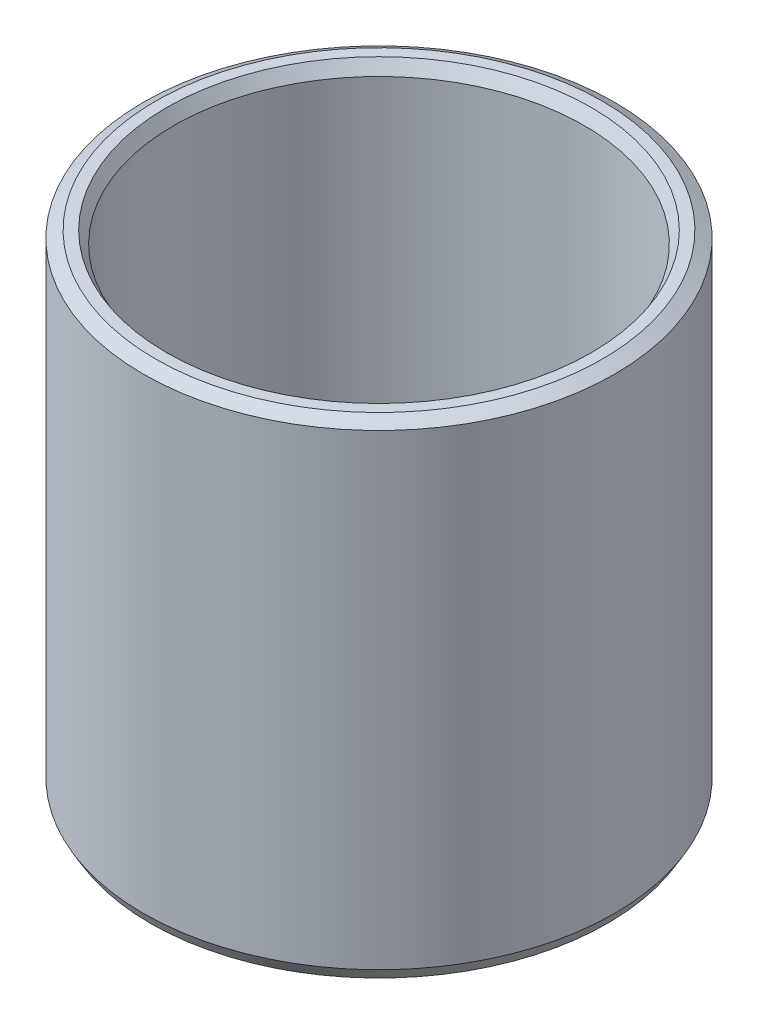
ISO-10303-21;
HEADER;
FILE_DESCRIPTION(('STEP AP214'),'2;1');
FILE_NAME('part.step','',(''),(''),'','','');
FILE_SCHEMA(('AUTOMOTIVE_DESIGN { 1 0 10303 214 1 1 1 1 }'));
ENDSEC;
DATA;
#1=APPLICATION_CONTEXT('core data for automotive mechanical design processes');
#2=APPLICATION_PROTOCOL_DEFINITION('international standard','automotive_design',2000,#1);
#3=PRODUCT_CONTEXT('',#1,'mechanical');
#4=PRODUCT('Part','Part','',(#3));
#5=PRODUCT_RELATED_PRODUCT_CATEGORY('part','',(#4));
#6=PRODUCT_DEFINITION_FORMATION('','',#4);
#7=PRODUCT_DEFINITION_CONTEXT('part definition',#1,'design');
#8=PRODUCT_DEFINITION('design','',#6,#7);
#9=PRODUCT_DEFINITION_SHAPE('','',#8);
#10=(LENGTH_UNIT() NAMED_UNIT(*) SI_UNIT(.MILLI.,.METRE.));
#11=(NAMED_UNIT(*) PLANE_ANGLE_UNIT() SI_UNIT($,.RADIAN.));
#12=(NAMED_UNIT(*) SI_UNIT($,.STERADIAN.) SOLID_ANGLE_UNIT());
#13=UNCERTAINTY_MEASURE_WITH_UNIT(LENGTH_MEASURE(1.E-05),#10,'distance_accuracy_value','');
#14=(GEOMETRIC_REPRESENTATION_CONTEXT(3) GLOBAL_UNCERTAINTY_ASSIGNED_CONTEXT((#13)) GLOBAL_UNIT_ASSIGNED_CONTEXT((#10,
#11,#12)) REPRESENTATION_CONTEXT('',''));
#15=CARTESIAN_POINT('',(0.,0.,0.));
#16=DIRECTION('',(0.,0.,1.));
#17=DIRECTION('',(1.,0.,0.));
#18=AXIS2_PLACEMENT_3D('',#15,#16,#17);
#19=CARTESIAN_POINT('',(0.,72.2339889807118,0.));
#20=DIRECTION('',(0.,-1.,0.));
#21=DIRECTION('',(0.,0.,-1.));
#22=AXIS2_PLACEMENT_3D('',#19,#20,#21);
#23=CYLINDRICAL_SURFACE('',#22,35.);
#24=CARTESIAN_POINT('',(0.,1.80621236917806,0.));
#25=DIRECTION('',(0.,1.,0.));
#26=DIRECTION('',(0.,0.,1.));
#27=AXIS2_PLACEMENT_3D('',#24,#25,#26);
#28=CIRCLE('',#27,35.);
#29=CARTESIAN_POINT('',(0.,1.80621236917806,35.));
#30=VERTEX_POINT('',#29);
#31=EDGE_CURVE('E10',#30,#30,#28,.T.);
#32=ORIENTED_EDGE('',*,*,#31,.T.);
#33=EDGE_LOOP('',(#32));
#34=FACE_BOUND('',#33,.T.);
#35=CARTESIAN_POINT('',(0.,71.1911717831532,0.));
#36=DIRECTION('',(0.,1.,0.));
#37=DIRECTION('',(0.,0.,1.));
#38=AXIS2_PLACEMENT_3D('',#35,#36,#37);
#39=CIRCLE('',#38,35.);
#40=CARTESIAN_POINT('',(0.,71.1911717831532,35.));
#41=VERTEX_POINT('',#40);
#42=EDGE_CURVE('E50',#41,#41,#39,.F.);
#43=ORIENTED_EDGE('',*,*,#42,.T.);
#44=EDGE_LOOP('',(#43));
#45=FACE_BOUND('',#44,.T.);
#46=ADVANCED_FACE('F39',(#34,#45),#23,.T.);
#47=CARTESIAN_POINT('',(0.,72.2339889807118,0.));
#48=DIRECTION('',(0.,1.,0.));
#49=DIRECTION('',(0.,0.,1.));
#50=AXIS2_PLACEMENT_3D('',#47,#48,#49);
#51=PLANE('',#50);
#52=CARTESIAN_POINT('',(0.,72.2339889807118,0.));
#53=DIRECTION('',(0.,1.,0.));
#54=DIRECTION('',(0.,0.,1.));
#55=AXIS2_PLACEMENT_3D('',#52,#53,#54);
#56=CIRCLE('',#55,31.5551612675775);
#57=CARTESIAN_POINT('',(0.,72.2339889807118,31.5551612675775));
#58=VERTEX_POINT('',#57);
#59=EDGE_CURVE('E58',#58,#58,#56,.F.);
#60=ORIENTED_EDGE('',*,*,#59,.T.);
#61=EDGE_LOOP('',(#60));
#62=FACE_BOUND('',#61,.T.);
#63=CARTESIAN_POINT('',(0.,72.2339889807118,0.));
#64=DIRECTION('',(0.,1.,0.));
#65=DIRECTION('',(0.,0.,1.));
#66=AXIS2_PLACEMENT_3D('',#63,#64,#65);
#67=CIRCLE('',#66,33.193787630822);
#68=CARTESIAN_POINT('',(0.,72.2339889807118,33.193787630822));
#69=VERTEX_POINT('',#68);
#70=EDGE_CURVE('E61',#69,#69,#67,.T.);
#71=ORIENTED_EDGE('',*,*,#70,.T.);
#72=EDGE_LOOP('',(#71));
#73=FACE_BOUND('',#72,.T.);
#74=ADVANCED_FACE('F88',(#62,#73),#51,.T.);
#75=CARTESIAN_POINT('',(0.,0.,0.));
#76=DIRECTION('',(0.,1.,0.));
#77=DIRECTION('',(0.,0.,1.));
#78=AXIS2_PLACEMENT_3D('',#75,#76,#77);
#79=PLANE('',#78);
#80=CARTESIAN_POINT('',(0.,0.,0.));
#81=DIRECTION('',(0.,1.,0.));
#82=DIRECTION('',(0.,0.,1.));
#83=AXIS2_PLACEMENT_3D('',#80,#81,#82);
#84=CIRCLE('',#83,32.318556439197);
#85=CARTESIAN_POINT('',(0.,0.,32.318556439197));
#86=VERTEX_POINT('',#85);
#87=EDGE_CURVE('E51',#86,#86,#84,.T.);
#88=ORIENTED_EDGE('',*,*,#87,.T.);
#89=EDGE_LOOP('',(#88));
#90=FACE_BOUND('',#89,.T.);
#91=CARTESIAN_POINT('',(0.,0.,0.));
#92=DIRECTION('',(0.,1.,0.));
#93=DIRECTION('',(0.,0.,1.));
#94=AXIS2_PLACEMENT_3D('',#91,#92,#93);
#95=CIRCLE('',#94,33.9571828024414);
#96=CARTESIAN_POINT('',(0.,0.,33.9571828024414));
#97=VERTEX_POINT('',#96);
#98=EDGE_CURVE('E54',#97,#97,#95,.F.);
#99=ORIENTED_EDGE('',*,*,#98,.T.);
#100=EDGE_LOOP('',(#99));
#101=FACE_BOUND('',#100,.T.);
#102=ADVANCED_FACE('F83',(#90,#101),#79,.F.);
#103=CARTESIAN_POINT('',(0.,72.2339889807118,0.));
#104=DIRECTION('',(0.,-1.,0.));
#105=DIRECTION('',(0.,0.,-1.));
#106=AXIS2_PLACEMENT_3D('',#103,#104,#105);
#107=CYLINDRICAL_SURFACE('',#106,30.5123440700189);
#108=CARTESIAN_POINT('',(0.,70.4277766115337,0.));
#109=DIRECTION('',(0.,1.,0.));
#110=DIRECTION('',(0.,0.,1.));
#111=AXIS2_PLACEMENT_3D('',#108,#109,#110);
#112=CIRCLE('',#111,30.5123440700189);
#113=CARTESIAN_POINT('',(0.,70.4277766115337,30.5123440700189));
#114=VERTEX_POINT('',#113);
#115=EDGE_CURVE('E67',#114,#114,#112,.T.);
#116=ORIENTED_EDGE('',*,*,#115,.T.);
#117=EDGE_LOOP('',(#116));
#118=FACE_BOUND('',#117,.T.);
#119=CARTESIAN_POINT('',(0.,1.04281719755861,0.));
#120=DIRECTION('',(0.,1.,0.));
#121=DIRECTION('',(0.,0.,1.));
#122=AXIS2_PLACEMENT_3D('',#119,#120,#121);
#123=CIRCLE('',#122,30.5123440700189);
#124=CARTESIAN_POINT('',(0.,1.04281719755861,30.5123440700189));
#125=VERTEX_POINT('',#124);
#126=EDGE_CURVE('E69',#125,#125,#123,.F.);
#127=ORIENTED_EDGE('',*,*,#126,.T.);
#128=EDGE_LOOP('',(#127));
#129=FACE_BOUND('',#128,.T.);
#130=ADVANCED_FACE('F71',(#118,#129),#107,.F.);
#131=CARTESIAN_POINT('',(0.,70.4277766115337,0.));
#132=DIRECTION('',(0.,1.,0.));
#133=DIRECTION('',(0.,0.,1.));
#134=AXIS2_PLACEMENT_3D('',#131,#132,#133);
#135=CONICAL_SURFACE('',#134,30.5123440700189,0.523598775598293);
#136=ORIENTED_EDGE('',*,*,#59,.F.);
#137=EDGE_LOOP('',(#136));
#138=FACE_BOUND('',#137,.T.);
#139=ORIENTED_EDGE('',*,*,#115,.F.);
#140=EDGE_LOOP('',(#139));
#141=FACE_BOUND('',#140,.T.);
#142=ADVANCED_FACE('F77',(#138,#141),#135,.F.);
#143=CARTESIAN_POINT('',(0.,0.,0.));
#144=DIRECTION('',(0.,-1.,0.));
#145=DIRECTION('',(0.,0.,-1.));
#146=AXIS2_PLACEMENT_3D('',#143,#144,#145);
#147=CONICAL_SURFACE('',#146,32.318556439197,1.04719755119659);
#148=ORIENTED_EDGE('',*,*,#126,.F.);
#149=EDGE_LOOP('',(#148));
#150=FACE_BOUND('',#149,.T.);
#151=ORIENTED_EDGE('',*,*,#87,.F.);
#152=EDGE_LOOP('',(#151));
#153=FACE_BOUND('',#152,.T.);
#154=ADVANCED_FACE('F73',(#150,#153),#147,.F.);
#155=CARTESIAN_POINT('',(0.,1.80621236917806,0.));
#156=DIRECTION('',(0.,1.,0.));
#157=DIRECTION('',(0.,0.,1.));
#158=AXIS2_PLACEMENT_3D('',#155,#156,#157);
#159=CONICAL_SURFACE('',#158,35.,0.5235987755983);
#160=CARTESIAN_POINT('',(0.,0.,33.9571828024414));
#161=CARTESIAN_POINT('',(0.,0.0188147121789396,33.9680454815826));
#162=CARTESIAN_POINT('',(0.,0.0376294243578772,33.9789081607239));
#163=CARTESIAN_POINT('',(0.,0.0752588487157524,34.0006335190064));
#164=CARTESIAN_POINT('',(0.,0.09407356089469,34.0114961981476));
#165=CARTESIAN_POINT('',(0.,0.131702985252567,34.0332215564301));
#166=CARTESIAN_POINT('',(0.,0.150517697431506,34.0440842355713));
#167=CARTESIAN_POINT('',(0.,0.188147121789382,34.0658095938538));
#168=CARTESIAN_POINT('',(0.,0.206961833968319,34.076672272995));
#169=CARTESIAN_POINT('',(0.,0.244591258326195,34.0983976312775));
#170=CARTESIAN_POINT('',(0.,0.263405970505134,34.1092603104187));
#171=CARTESIAN_POINT('',(0.,0.301035394863011,34.1309856687012));
#172=CARTESIAN_POINT('',(0.,0.319850107041949,34.1418483478424));
#173=CARTESIAN_POINT('',(0.,0.357479531399825,34.1635737061249));
#174=CARTESIAN_POINT('',(0.,0.376294243578763,34.1744363852661));
#175=CARTESIAN_POINT('',(0.,0.413923667936639,34.1961617435486));
#176=CARTESIAN_POINT('',(0.,0.432738380115578,34.2070244226898));
#177=CARTESIAN_POINT('',(0.,0.470367804473455,34.2287497809723));
#178=CARTESIAN_POINT('',(0.,0.489182516652392,34.2396124601135));
#179=CARTESIAN_POINT('',(0.,0.526811941010268,34.261337818396));
#180=CARTESIAN_POINT('',(0.,0.545626653189206,34.2722004975372));
#181=CARTESIAN_POINT('',(0.,0.583256077547084,34.2939258558197));
#182=CARTESIAN_POINT('',(0.,0.602070789726022,34.3047885349609));
#183=CARTESIAN_POINT('',(0.,0.639700214083898,34.3265138932434));
#184=CARTESIAN_POINT('',(0.,0.658514926262835,34.3373765723847));
#185=CARTESIAN_POINT('',(0.,0.696144350620712,34.3591019306671));
#186=CARTESIAN_POINT('',(0.,0.714959062799651,34.3699646098084));
#187=CARTESIAN_POINT('',(0.,0.752588487157527,34.3916899680908));
#188=CARTESIAN_POINT('',(0.,0.771403199336465,34.4025526472321));
#189=CARTESIAN_POINT('',(0.,0.809032623694341,34.4242780055145));
#190=CARTESIAN_POINT('',(0.,0.827847335873279,34.4351406846558));
#191=CARTESIAN_POINT('',(0.,0.865476760231156,34.4568660429382));
#192=CARTESIAN_POINT('',(0.,0.884291472410095,34.4677287220795));
#193=CARTESIAN_POINT('',(0.,0.921920896767971,34.489454080362));
#194=CARTESIAN_POINT('',(0.,0.940735608946908,34.5003167595032));
#195=CARTESIAN_POINT('',(0.,0.978365033304784,34.5220421177857));
#196=CARTESIAN_POINT('',(0.,0.997179745483724,34.5329047969269));
#197=CARTESIAN_POINT('',(0.,1.0348091698416,34.5546301552094));
#198=CARTESIAN_POINT('',(0.,1.05362388202054,34.5654928343506));
#199=CARTESIAN_POINT('',(0.,1.09125330637841,34.5872181926331));
#200=CARTESIAN_POINT('',(0.,1.11006801855735,34.5980808717743));
#201=CARTESIAN_POINT('',(0.,1.14769744291523,34.6198062300568));
#202=CARTESIAN_POINT('',(0.,1.16651215509417,34.630668909198));
#203=CARTESIAN_POINT('',(0.,1.20414157945204,34.6523942674805));
#204=CARTESIAN_POINT('',(0.,1.22295629163098,34.6632569466217));
#205=CARTESIAN_POINT('',(0.,1.26058571598886,34.6849823049042));
#206=CARTESIAN_POINT('',(0.,1.2794004281678,34.6958449840454));
#207=CARTESIAN_POINT('',(0.,1.31702985252567,34.7175703423279));
#208=CARTESIAN_POINT('',(0.,1.33584456470461,34.7284330214691));
#209=CARTESIAN_POINT('',(0.,1.37347398906249,34.7501583797516));
#210=CARTESIAN_POINT('',(0.,1.39228870124143,34.7610210588928));
#211=CARTESIAN_POINT('',(0.,1.4299181255993,34.7827464171753));
#212=CARTESIAN_POINT('',(0.,1.44873283777824,34.7936090963165));
#213=CARTESIAN_POINT('',(0.,1.48636226213611,34.815334454599));
#214=CARTESIAN_POINT('',(0.,1.50517697431505,34.8261971337402));
#215=CARTESIAN_POINT('',(0.,1.54280639867293,34.8479224920227));
#216=CARTESIAN_POINT('',(0.,1.56162111085187,34.8587851711639));
#217=CARTESIAN_POINT('',(0.,1.59925053520975,34.8805105294464));
#218=CARTESIAN_POINT('',(0.,1.61806524738868,34.8913732085877));
#219=CARTESIAN_POINT('',(0.,1.65569467174656,34.9130985668701));
#220=CARTESIAN_POINT('',(0.,1.6745093839255,34.9239612460114));
#221=CARTESIAN_POINT('',(0.,1.71213880828337,34.9456866042938));
#222=CARTESIAN_POINT('',(0.,1.73095352046231,34.9565492834351));
#223=CARTESIAN_POINT('',(0.,1.76858294482019,34.9782746417175));
#224=CARTESIAN_POINT('',(0.,1.78739765699912,34.9891373208588));
#225=CARTESIAN_POINT('',(0.,1.80621236917806,35.));
#226=B_SPLINE_CURVE_WITH_KNOTS('',3,(#160,#161,#162,#163,#164,#165,#166,#167,#168,#169,#170,
#171,#172,#173,#174,#175,#176,#177,#178,#179,#180,#181,#182,#183,#184,#185,#186,#187,#188,#189,
#190,#191,#192,#193,#194,#195,#196,#197,#198,#199,#200,#201,#202,#203,#204,#205,#206,#207,#208,
#209,#210,#211,#212,#213,#214,#215,#216,#217,#218,#219,#220,#221,#222,#223,#224,#225),
.UNSPECIFIED.,.F.,.F.,(4,2,2,2,2,2,2,2,2,2,2,2,2,2,2,2,2,2,2,2,2,2,2,2,2,2,2,2,2,2,2,2,4),(0.,
0.0651760748474103,0.130352149694824,0.195528224542234,0.260704299389648,0.325880374237059,
0.391056449084469,0.456232523931883,0.521408598779293,0.586584673626707,0.651760748474117,
0.716936823321527,0.782112898168941,0.847288973016352,0.912465047863765,0.977641122711175,
1.04281719755859,1.107993272406,1.17316934725341,1.23834542210082,1.30352149694823,
1.36869757179565,1.43387364664306,1.49904972149047,1.56422579633788,1.62940187118529,
1.69457794603271,1.75975402088012,1.82493009572753,1.89010617057494,1.95528224542235,
2.02045832026977,2.08563439511718),.UNSPECIFIED.);
#227=EDGE_CURVE('BSEAM76',#97,#30,#226,.T.);
#228=ORIENTED_EDGE('',*,*,#98,.F.);
#229=ORIENTED_EDGE('',*,*,#31,.F.);
#230=ORIENTED_EDGE('',*,*,#227,.T.);
#231=ORIENTED_EDGE('',*,*,#227,.F.);
#232=EDGE_LOOP('',(#228,#230,#229,#231));
#233=FACE_BOUND('',#232,.T.);
#234=ADVANCED_FACE('F76',(#233),#159,.T.);
#235=CARTESIAN_POINT('',(0.,72.2339889807118,0.));
#236=DIRECTION('',(0.,-1.,0.));
#237=DIRECTION('',(0.,0.,-1.));
#238=AXIS2_PLACEMENT_3D('',#235,#236,#237);
#239=CONICAL_SURFACE('',#238,33.193787630822,1.04719755119658);
#240=ORIENTED_EDGE('',*,*,#42,.F.);
#241=EDGE_LOOP('',(#240));
#242=FACE_BOUND('',#241,.T.);
#243=ORIENTED_EDGE('',*,*,#70,.F.);
#244=EDGE_LOOP('',(#243));
#245=FACE_BOUND('',#244,.T.);
#246=ADVANCED_FACE('F45',(#242,#245),#239,.T.);
#247=CLOSED_SHELL('',(#46,#74,#102,#130,#142,#154,#234,#246));
#248=MANIFOLD_SOLID_BREP('B2',#247);
#249=ADVANCED_BREP_SHAPE_REPRESENTATION('',(#18,#248),#14);
#250=SHAPE_DEFINITION_REPRESENTATION(#9,#249);
ENDSEC;
END-ISO-10303-21;
